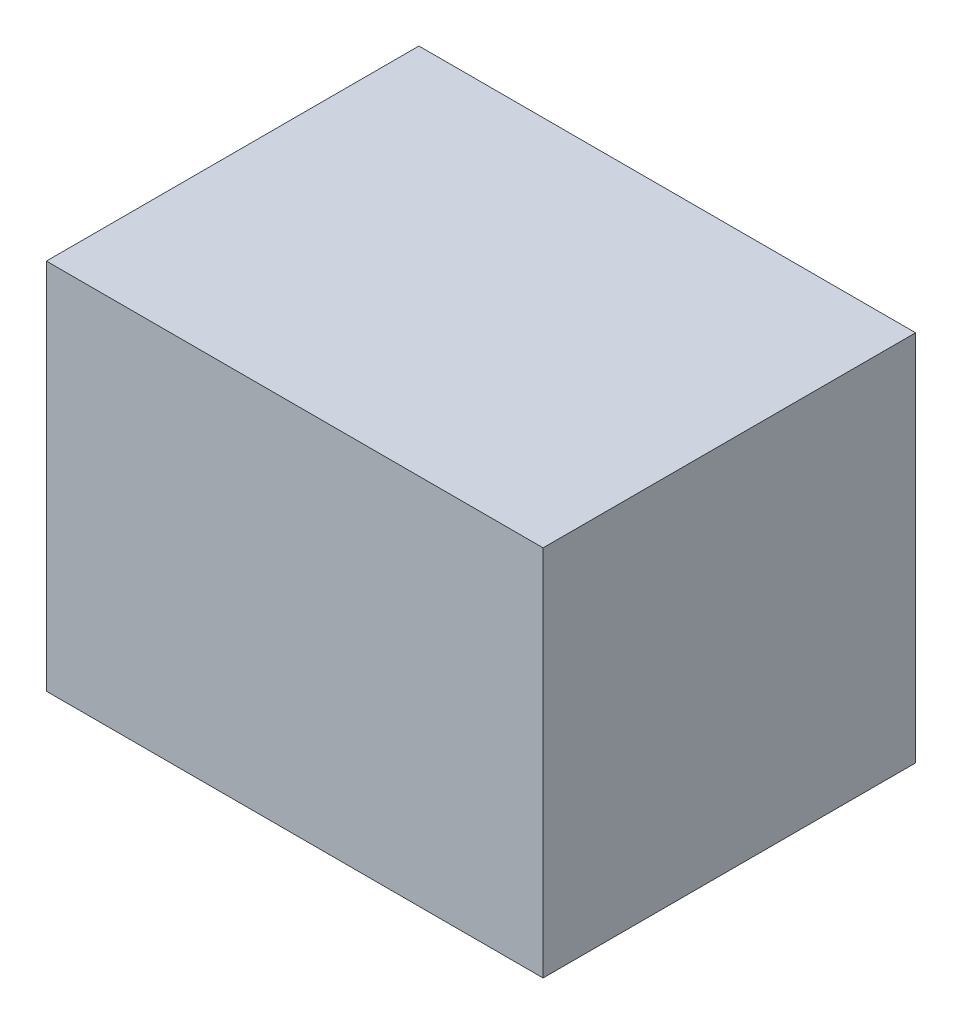
ISO-10303-21;
HEADER;
FILE_DESCRIPTION(('STEP AP214'),'2;1');
FILE_NAME('part.step','',(''),(''),'','','');
FILE_SCHEMA(('AUTOMOTIVE_DESIGN { 1 0 10303 214 1 1 1 1 }'));
ENDSEC;
DATA;
#1=APPLICATION_CONTEXT('core data for automotive mechanical design processes');
#2=APPLICATION_PROTOCOL_DEFINITION('international standard','automotive_design',2000,#1);
#3=PRODUCT_CONTEXT('',#1,'mechanical');
#4=PRODUCT('Part','Part','',(#3));
#5=PRODUCT_RELATED_PRODUCT_CATEGORY('part','',(#4));
#6=PRODUCT_DEFINITION_FORMATION('','',#4);
#7=PRODUCT_DEFINITION_CONTEXT('part definition',#1,'design');
#8=PRODUCT_DEFINITION('design','',#6,#7);
#9=PRODUCT_DEFINITION_SHAPE('','',#8);
#10=(LENGTH_UNIT() NAMED_UNIT(*) SI_UNIT(.MILLI.,.METRE.));
#11=(NAMED_UNIT(*) PLANE_ANGLE_UNIT() SI_UNIT($,.RADIAN.));
#12=(NAMED_UNIT(*) SI_UNIT($,.STERADIAN.) SOLID_ANGLE_UNIT());
#13=UNCERTAINTY_MEASURE_WITH_UNIT(LENGTH_MEASURE(1.E-05),#10,'distance_accuracy_value','');
#14=(GEOMETRIC_REPRESENTATION_CONTEXT(3) GLOBAL_UNCERTAINTY_ASSIGNED_CONTEXT((#13)) GLOBAL_UNIT_ASSIGNED_CONTEXT((#10,
#11,#12)) REPRESENTATION_CONTEXT('',''));
#15=CARTESIAN_POINT('',(0.,0.,0.));
#16=DIRECTION('',(0.,0.,1.));
#17=DIRECTION('',(1.,0.,0.));
#18=AXIS2_PLACEMENT_3D('',#15,#16,#17);
#19=CARTESIAN_POINT('',(0.,0.,3.));
#20=DIRECTION('',(1.,0.,0.));
#21=DIRECTION('',(0.,0.,-1.));
#22=AXIS2_PLACEMENT_3D('',#19,#20,#21);
#23=PLANE('',#22);
#24=DIRECTION('',(0.,-1.,0.));
#25=VECTOR('',#24,1.);
#26=CARTESIAN_POINT('',(0.,0.,0.));
#27=LINE('',#26,#25);
#28=CARTESIAN_POINT('',(0.,3.,0.));
#29=VERTEX_POINT('',#28);
#30=CARTESIAN_POINT('',(0.,0.,0.));
#31=VERTEX_POINT('',#30);
#32=EDGE_CURVE('E95',#29,#31,#27,.T.);
#33=ORIENTED_EDGE('',*,*,#32,.T.);
#34=DIRECTION('',(0.,0.,-1.));
#35=VECTOR('',#34,1.);
#36=CARTESIAN_POINT('',(0.,0.,3.));
#37=LINE('',#36,#35);
#38=CARTESIAN_POINT('',(0.,0.,3.));
#39=VERTEX_POINT('',#38);
#40=EDGE_CURVE('E11',#39,#31,#37,.T.);
#41=ORIENTED_EDGE('',*,*,#40,.F.);
#42=DIRECTION('',(0.,-1.,0.));
#43=VECTOR('',#42,1.);
#44=CARTESIAN_POINT('',(0.,0.,3.));
#45=LINE('',#44,#43);
#46=CARTESIAN_POINT('',(0.,3.,3.));
#47=VERTEX_POINT('',#46);
#48=EDGE_CURVE('E83',#47,#39,#45,.T.);
#49=ORIENTED_EDGE('',*,*,#48,.F.);
#50=DIRECTION('',(0.,0.,-1.));
#51=VECTOR('',#50,1.);
#52=CARTESIAN_POINT('',(0.,3.,3.));
#53=LINE('',#52,#51);
#54=EDGE_CURVE('E91',#47,#29,#53,.T.);
#55=ORIENTED_EDGE('',*,*,#54,.T.);
#56=EDGE_LOOP('',(#33,#41,#49,#55));
#57=FACE_BOUND('',#56,.T.);
#58=ADVANCED_FACE('F32',(#57),#23,.F.);
#59=CARTESIAN_POINT('',(0.,0.,3.));
#60=DIRECTION('',(0.,1.,0.));
#61=DIRECTION('',(0.,0.,1.));
#62=AXIS2_PLACEMENT_3D('',#59,#60,#61);
#63=PLANE('',#62);
#64=DIRECTION('',(1.,0.,0.));
#65=VECTOR('',#64,1.);
#66=CARTESIAN_POINT('',(0.,0.,0.));
#67=LINE('',#66,#65);
#68=CARTESIAN_POINT('',(4.,0.,0.));
#69=VERTEX_POINT('',#68);
#70=EDGE_CURVE('E87',#31,#69,#67,.T.);
#71=ORIENTED_EDGE('',*,*,#70,.T.);
#72=DIRECTION('',(0.,0.,-1.));
#73=VECTOR('',#72,1.);
#74=CARTESIAN_POINT('',(4.,0.,3.));
#75=LINE('',#74,#73);
#76=CARTESIAN_POINT('',(4.,0.,3.));
#77=VERTEX_POINT('',#76);
#78=EDGE_CURVE('E40',#77,#69,#75,.T.);
#79=ORIENTED_EDGE('',*,*,#78,.F.);
#80=DIRECTION('',(1.,0.,0.));
#81=VECTOR('',#80,1.);
#82=CARTESIAN_POINT('',(0.,0.,3.));
#83=LINE('',#82,#81);
#84=EDGE_CURVE('E78',#39,#77,#83,.T.);
#85=ORIENTED_EDGE('',*,*,#84,.F.);
#86=ORIENTED_EDGE('',*,*,#40,.T.);
#87=EDGE_LOOP('',(#71,#79,#85,#86));
#88=FACE_BOUND('',#87,.T.);
#89=ADVANCED_FACE('F86',(#88),#63,.F.);
#90=CARTESIAN_POINT('',(4.,0.,3.));
#91=DIRECTION('',(-1.,0.,0.));
#92=DIRECTION('',(0.,0.,1.));
#93=AXIS2_PLACEMENT_3D('',#90,#91,#92);
#94=PLANE('',#93);
#95=DIRECTION('',(0.,1.,0.));
#96=VECTOR('',#95,1.);
#97=CARTESIAN_POINT('',(4.,0.,0.));
#98=LINE('',#97,#96);
#99=CARTESIAN_POINT('',(4.,3.,0.));
#100=VERTEX_POINT('',#99);
#101=EDGE_CURVE('E65',#69,#100,#98,.T.);
#102=ORIENTED_EDGE('',*,*,#101,.T.);
#103=DIRECTION('',(0.,0.,-1.));
#104=VECTOR('',#103,1.);
#105=CARTESIAN_POINT('',(4.,3.,3.));
#106=LINE('',#105,#104);
#107=CARTESIAN_POINT('',(4.,3.,3.));
#108=VERTEX_POINT('',#107);
#109=EDGE_CURVE('E88',#108,#100,#106,.T.);
#110=ORIENTED_EDGE('',*,*,#109,.F.);
#111=DIRECTION('',(0.,1.,0.));
#112=VECTOR('',#111,1.);
#113=CARTESIAN_POINT('',(4.,0.,3.));
#114=LINE('',#113,#112);
#115=EDGE_CURVE('E81',#77,#108,#114,.T.);
#116=ORIENTED_EDGE('',*,*,#115,.F.);
#117=ORIENTED_EDGE('',*,*,#78,.T.);
#118=EDGE_LOOP('',(#102,#110,#116,#117));
#119=FACE_BOUND('',#118,.T.);
#120=ADVANCED_FACE('F89',(#119),#94,.F.);
#121=CARTESIAN_POINT('',(0.,3.,3.));
#122=DIRECTION('',(0.,-1.,0.));
#123=DIRECTION('',(0.,0.,-1.));
#124=AXIS2_PLACEMENT_3D('',#121,#122,#123);
#125=PLANE('',#124);
#126=DIRECTION('',(-1.,0.,0.));
#127=VECTOR('',#126,1.);
#128=CARTESIAN_POINT('',(0.,3.,0.));
#129=LINE('',#128,#127);
#130=EDGE_CURVE('E71',#100,#29,#129,.T.);
#131=ORIENTED_EDGE('',*,*,#130,.T.);
#132=ORIENTED_EDGE('',*,*,#54,.F.);
#133=DIRECTION('',(-1.,0.,0.));
#134=VECTOR('',#133,1.);
#135=CARTESIAN_POINT('',(0.,3.,3.));
#136=LINE('',#135,#134);
#137=EDGE_CURVE('E48',#108,#47,#136,.T.);
#138=ORIENTED_EDGE('',*,*,#137,.F.);
#139=ORIENTED_EDGE('',*,*,#109,.T.);
#140=EDGE_LOOP('',(#131,#132,#138,#139));
#141=FACE_BOUND('',#140,.T.);
#142=ADVANCED_FACE('F102',(#141),#125,.F.);
#143=CARTESIAN_POINT('',(0.,0.,3.));
#144=DIRECTION('',(0.,0.,-1.));
#145=DIRECTION('',(-1.,0.,0.));
#146=AXIS2_PLACEMENT_3D('',#143,#144,#145);
#147=PLANE('',#146);
#148=ORIENTED_EDGE('',*,*,#48,.T.);
#149=ORIENTED_EDGE('',*,*,#84,.T.);
#150=ORIENTED_EDGE('',*,*,#115,.T.);
#151=ORIENTED_EDGE('',*,*,#137,.T.);
#152=EDGE_LOOP('',(#148,#149,#150,#151));
#153=FACE_BOUND('',#152,.T.);
#154=ADVANCED_FACE('F79',(#153),#147,.F.);
#155=CARTESIAN_POINT('',(0.,0.,0.));
#156=DIRECTION('',(0.,0.,-1.));
#157=DIRECTION('',(-1.,0.,0.));
#158=AXIS2_PLACEMENT_3D('',#155,#156,#157);
#159=PLANE('',#158);
#160=ORIENTED_EDGE('',*,*,#32,.F.);
#161=ORIENTED_EDGE('',*,*,#130,.F.);
#162=ORIENTED_EDGE('',*,*,#101,.F.);
#163=ORIENTED_EDGE('',*,*,#70,.F.);
#164=EDGE_LOOP('',(#160,#161,#162,#163));
#165=FACE_BOUND('',#164,.T.);
#166=ADVANCED_FACE('F105',(#165),#159,.T.);
#167=CLOSED_SHELL('',(#58,#89,#120,#142,#154,#166));
#168=MANIFOLD_SOLID_BREP('B2',#167);
#169=ADVANCED_BREP_SHAPE_REPRESENTATION('',(#18,#168),#14);
#170=SHAPE_DEFINITION_REPRESENTATION(#9,#169);
ENDSEC;
END-ISO-10303-21;
